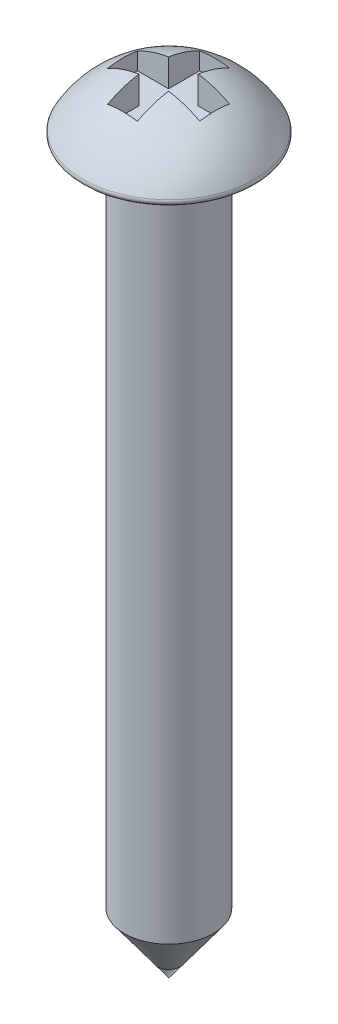
ISO-10303-21;
HEADER;
FILE_DESCRIPTION(('STEP AP214'),'2;1');
FILE_NAME('part.step','',(''),(''),'','','');
FILE_SCHEMA(('AUTOMOTIVE_DESIGN { 1 0 10303 214 1 1 1 1 }'));
ENDSEC;
DATA;
#1=APPLICATION_CONTEXT('core data for automotive mechanical design processes');
#2=APPLICATION_PROTOCOL_DEFINITION('international standard','automotive_design',2000,#1);
#3=PRODUCT_CONTEXT('',#1,'mechanical');
#4=PRODUCT('Part','Part','',(#3));
#5=PRODUCT_RELATED_PRODUCT_CATEGORY('part','',(#4));
#6=PRODUCT_DEFINITION_FORMATION('','',#4);
#7=PRODUCT_DEFINITION_CONTEXT('part definition',#1,'design');
#8=PRODUCT_DEFINITION('design','',#6,#7);
#9=PRODUCT_DEFINITION_SHAPE('','',#8);
#10=(LENGTH_UNIT() NAMED_UNIT(*) SI_UNIT(.MILLI.,.METRE.));
#11=(NAMED_UNIT(*) PLANE_ANGLE_UNIT() SI_UNIT($,.RADIAN.));
#12=(NAMED_UNIT(*) SI_UNIT($,.STERADIAN.) SOLID_ANGLE_UNIT());
#13=UNCERTAINTY_MEASURE_WITH_UNIT(LENGTH_MEASURE(1.E-05),#10,'distance_accuracy_value','');
#14=(GEOMETRIC_REPRESENTATION_CONTEXT(3) GLOBAL_UNCERTAINTY_ASSIGNED_CONTEXT((#13)) GLOBAL_UNIT_ASSIGNED_CONTEXT((#10,
#11,#12)) REPRESENTATION_CONTEXT('',''));
#15=CARTESIAN_POINT('',(0.,0.,0.));
#16=DIRECTION('',(0.,0.,1.));
#17=DIRECTION('',(1.,0.,0.));
#18=AXIS2_PLACEMENT_3D('',#15,#16,#17);
#19=CARTESIAN_POINT('',(0.,-18.,0.));
#20=DIRECTION('',(0.,1.,0.));
#21=DIRECTION('',(-1.,0.,0.));
#22=AXIS2_PLACEMENT_3D('',#19,#20,#21);
#23=CONICAL_SURFACE('',#22,0.,0.632748835002184);
#24=CARTESIAN_POINT('',(0.,-16.5,0.));
#25=DIRECTION('',(0.,1.,0.));
#26=DIRECTION('',(-1.,0.,0.));
#27=AXIS2_PLACEMENT_3D('',#24,#25,#26);
#28=CIRCLE('',#27,1.1);
#29=CARTESIAN_POINT('',(-1.1,-16.5,0.));
#30=VERTEX_POINT('',#29);
#31=EDGE_CURVE('E199',#30,#30,#28,.T.);
#32=ORIENTED_EDGE('',*,*,#31,.F.);
#33=EDGE_LOOP('',(#32));
#34=FACE_BOUND('',#33,.T.);
#35=CARTESIAN_POINT('',(0.,-18.,0.));
#36=VERTEX_POINT('',#35);
#37=VERTEX_LOOP('',#36);
#38=FACE_BOUND('',#37,.T.);
#39=ADVANCED_FACE('F31',(#34,#38),#23,.T.);
#40=CARTESIAN_POINT('',(0.,3.8000547936802,0.));
#41=DIRECTION('',(0.,1.,0.));
#42=DIRECTION('',(-1.,0.,0.));
#43=AXIS2_PLACEMENT_3D('',#40,#41,#42);
#44=CYLINDRICAL_SURFACE('',#43,1.1);
#45=CARTESIAN_POINT('',(0.,0.,0.));
#46=DIRECTION('',(0.,1.,0.));
#47=DIRECTION('',(-1.,0.,0.));
#48=AXIS2_PLACEMENT_3D('',#45,#46,#47);
#49=CIRCLE('',#48,1.1);
#50=CARTESIAN_POINT('',(-1.1,0.,0.));
#51=VERTEX_POINT('',#50);
#52=EDGE_CURVE('E168',#51,#51,#49,.T.);
#53=ORIENTED_EDGE('',*,*,#52,.F.);
#54=EDGE_LOOP('',(#53));
#55=FACE_BOUND('',#54,.T.);
#56=ORIENTED_EDGE('',*,*,#31,.T.);
#57=EDGE_LOOP('',(#56));
#58=FACE_BOUND('',#57,.T.);
#59=ADVANCED_FACE('F277',(#55,#58),#44,.T.);
#60=CARTESIAN_POINT('',(2.2,0.,0.));
#61=DIRECTION('',(0.,1.,0.));
#62=DIRECTION('',(-1.,0.,0.));
#63=AXIS2_PLACEMENT_3D('',#60,#61,#62);
#64=PLANE('',#63);
#65=CARTESIAN_POINT('',(0.,0.,0.));
#66=DIRECTION('',(0.,1.,0.));
#67=DIRECTION('',(-1.,0.,0.));
#68=AXIS2_PLACEMENT_3D('',#65,#66,#67);
#69=CIRCLE('',#68,2.0359463499672);
#70=CARTESIAN_POINT('',(-2.0359463499672,0.,0.));
#71=VERTEX_POINT('',#70);
#72=EDGE_CURVE('E205',#71,#71,#69,.F.);
#73=ORIENTED_EDGE('',*,*,#72,.T.);
#74=EDGE_LOOP('',(#73));
#75=FACE_BOUND('',#74,.T.);
#76=ORIENTED_EDGE('',*,*,#52,.T.);
#77=EDGE_LOOP('',(#76));
#78=FACE_BOUND('',#77,.T.);
#79=ADVANCED_FACE('F282',(#75,#78),#64,.F.);
#80=CARTESIAN_POINT('',(0.,-1.04082556730939,0.));
#81=DIRECTION('',(0.,1.,0.));
#82=DIRECTION('',(1.,0.,0.));
#83=AXIS2_PLACEMENT_3D('',#80,#81,#82);
#84=SPHERICAL_SURFACE('',#83,2.43378673296674);
#85=CARTESIAN_POINT('',(0.,-1.04082556730939,0.370388630185053));
#86=DIRECTION('',(0.,0.,1.));
#87=DIRECTION('',(1.,0.,0.));
#88=AXIS2_PLACEMENT_3D('',#85,#86,#87);
#89=CIRCLE('',#88,2.40543761594321);
#90=CARTESIAN_POINT('',(1.13232028828451,1.08143287334618,0.370388630185053));
#91=VERTEX_POINT('',#90);
#92=CARTESIAN_POINT('',(0.361948002760647,1.33722484584255,0.370388630185053));
#93=VERTEX_POINT('',#92);
#94=EDGE_CURVE('E208',#91,#93,#89,.T.);
#95=ORIENTED_EDGE('',*,*,#94,.T.);
#96=CARTESIAN_POINT('',(0.361948002760647,-1.04082556730939,0.));
#97=DIRECTION('',(1.,0.,0.));
#98=DIRECTION('',(0.,0.,-1.));
#99=AXIS2_PLACEMENT_3D('',#96,#97,#98);
#100=CIRCLE('',#99,2.40672214949348);
#101=CARTESIAN_POINT('',(0.361948002760647,1.07836674063565,1.14076091570892));
#102=VERTEX_POINT('',#101);
#103=EDGE_CURVE('E11',#93,#102,#100,.T.);
#104=ORIENTED_EDGE('',*,*,#103,.T.);
#105=CARTESIAN_POINT('',(0.,-1.04082556730939,1.14076091570892));
#106=DIRECTION('',(0.,0.,1.));
#107=DIRECTION('',(1.,0.,0.));
#108=AXIS2_PLACEMENT_3D('',#105,#106,#107);
#109=CIRCLE('',#108,2.14987962331752);
#110=CARTESIAN_POINT('',(-0.371599949500931,1.07669559487218,1.14076091570892));
#111=VERTEX_POINT('',#110);
#112=EDGE_CURVE('E38',#102,#111,#109,.T.);
#113=ORIENTED_EDGE('',*,*,#112,.T.);
#114=CARTESIAN_POINT('',(-0.371599949500931,-1.04082556730939,0.));
#115=DIRECTION('',(-1.,0.,0.));
#116=DIRECTION('',(0.,0.,1.));
#117=AXIS2_PLACEMENT_3D('',#114,#115,#116);
#118=CIRCLE('',#117,2.40525078507332);
#119=CARTESIAN_POINT('',(-0.371599949500931,1.3357357303906,0.370388630185053));
#120=VERTEX_POINT('',#119);
#121=EDGE_CURVE('E234',#111,#120,#118,.T.);
#122=ORIENTED_EDGE('',*,*,#121,.T.);
#123=CARTESIAN_POINT('',(0.,-1.04082556730939,0.370388630185053));
#124=DIRECTION('',(0.,0.,1.));
#125=DIRECTION('',(1.,0.,0.));
#126=AXIS2_PLACEMENT_3D('',#123,#124,#125);
#127=CIRCLE('',#126,2.40543761594321);
#128=CARTESIAN_POINT('',(-1.14197223502479,1.07625486069211,0.370388630185054));
#129=VERTEX_POINT('',#128);
#130=EDGE_CURVE('E231',#120,#129,#127,.T.);
#131=ORIENTED_EDGE('',*,*,#130,.T.);
#132=CARTESIAN_POINT('',(-1.14197223502479,-1.04082556730939,0.));
#133=DIRECTION('',(-1.,0.,0.));
#134=DIRECTION('',(0.,0.,1.));
#135=AXIS2_PLACEMENT_3D('',#132,#133,#134);
#136=CIRCLE('',#135,2.14923644022648);
#137=CARTESIAN_POINT('',(-1.14197223502479,1.07750693321698,-0.363159322076525));
#138=VERTEX_POINT('',#137);
#139=EDGE_CURVE('E228',#129,#138,#136,.T.);
#140=ORIENTED_EDGE('',*,*,#139,.T.);
#141=CARTESIAN_POINT('',(0.,-1.04082556730939,-0.363159322076525));
#142=DIRECTION('',(0.,0.,-1.));
#143=DIRECTION('',(-1.,0.,0.));
#144=AXIS2_PLACEMENT_3D('',#141,#142,#143);
#145=CIRCLE('',#144,2.40653966689806);
#146=CARTESIAN_POINT('',(-0.371599949500931,1.33685116552978,-0.363159322076525));
#147=VERTEX_POINT('',#146);
#148=EDGE_CURVE('E225',#138,#147,#145,.T.);
#149=ORIENTED_EDGE('',*,*,#148,.T.);
#150=CARTESIAN_POINT('',(-0.371599949500931,-1.04082556730939,0.));
#151=DIRECTION('',(-1.,0.,0.));
#152=DIRECTION('',(0.,0.,1.));
#153=AXIS2_PLACEMENT_3D('',#150,#151,#152);
#154=CIRCLE('',#153,2.40525078507332);
#155=CARTESIAN_POINT('',(-0.371599949500931,1.08057430863731,-1.13353160760039));
#156=VERTEX_POINT('',#155);
#157=EDGE_CURVE('E222',#147,#156,#154,.T.);
#158=ORIENTED_EDGE('',*,*,#157,.T.);
#159=CARTESIAN_POINT('',(0.,-1.04082556730939,-1.13353160760039));
#160=DIRECTION('',(0.,0.,-1.));
#161=DIRECTION('',(-1.,0.,0.));
#162=AXIS2_PLACEMENT_3D('',#159,#160,#161);
#163=CIRCLE('',#162,2.15370006178572);
#164=CARTESIAN_POINT('',(0.361948002760647,1.08224240132312,-1.13353160760039));
#165=VERTEX_POINT('',#164);
#166=EDGE_CURVE('E219',#156,#165,#163,.T.);
#167=ORIENTED_EDGE('',*,*,#166,.T.);
#168=CARTESIAN_POINT('',(0.361948002760647,-1.04082556730939,0.));
#169=DIRECTION('',(1.,0.,0.));
#170=DIRECTION('',(0.,0.,-1.));
#171=AXIS2_PLACEMENT_3D('',#168,#169,#170);
#172=CIRCLE('',#171,2.40672214949348);
#173=CARTESIAN_POINT('',(0.361948002760647,1.33833958283286,-0.363159322076525));
#174=VERTEX_POINT('',#173);
#175=EDGE_CURVE('E216',#165,#174,#172,.T.);
#176=ORIENTED_EDGE('',*,*,#175,.T.);
#177=CARTESIAN_POINT('',(0.,-1.04082556730939,-0.363159322076525));
#178=DIRECTION('',(0.,0.,-1.));
#179=DIRECTION('',(-1.,0.,0.));
#180=AXIS2_PLACEMENT_3D('',#177,#178,#179);
#181=CIRCLE('',#180,2.40653966689806);
#182=CARTESIAN_POINT('',(1.13232028828451,1.0826818927889,-0.363159322076525));
#183=VERTEX_POINT('',#182);
#184=EDGE_CURVE('E213',#174,#183,#181,.T.);
#185=ORIENTED_EDGE('',*,*,#184,.T.);
#186=CARTESIAN_POINT('',(1.13232028828451,-1.04082556730939,0.));
#187=DIRECTION('',(1.,0.,0.));
#188=DIRECTION('',(0.,0.,-1.));
#189=AXIS2_PLACEMENT_3D('',#186,#187,#188);
#190=CIRCLE('',#189,2.15433716634704);
#191=EDGE_CURVE('E210',#183,#91,#190,.T.);
#192=ORIENTED_EDGE('',*,*,#191,.T.);
#193=EDGE_LOOP('',(#95,#104,#113,#122,#131,#140,#149,#158,#167,#176,#185,#192));
#194=FACE_BOUND('',#193,.T.);
#195=CARTESIAN_POINT('',(0.,0.148883025650727,0.));
#196=DIRECTION('',(0.,-1.,0.));
#197=DIRECTION('',(1.,0.,0.));
#198=AXIS2_PLACEMENT_3D('',#195,#196,#197);
#199=CIRCLE('',#198,2.12318424198226);
#200=CARTESIAN_POINT('',(2.12318424198226,0.148883025650727,0.));
#201=VERTEX_POINT('',#200);
#202=EDGE_CURVE('E202',#201,#201,#199,.F.);
#203=ORIENTED_EDGE('',*,*,#202,.T.);
#204=EDGE_LOOP('',(#203));
#205=FACE_BOUND('',#204,.T.);
#206=ADVANCED_FACE('F238',(#194,#205),#84,.T.);
#207=CARTESIAN_POINT('',(0.,0.0999999999999998,0.));
#208=DIRECTION('',(0.,1.,0.));
#209=DIRECTION('',(-1.,0.,0.));
#210=AXIS2_PLACEMENT_3D('',#207,#208,#209);
#211=TOROIDAL_SURFACE('',#210,2.0359463499672,0.1);
#212=ORIENTED_EDGE('',*,*,#72,.F.);
#213=EDGE_LOOP('',(#212));
#214=FACE_BOUND('',#213,.T.);
#215=ORIENTED_EDGE('',*,*,#202,.F.);
#216=EDGE_LOOP('',(#215));
#217=FACE_BOUND('',#216,.T.);
#218=ADVANCED_FACE('F295',(#214,#217),#211,.T.);
#219=CARTESIAN_POINT('',(0.361948002760647,0.656537419888082,1.14076091570892));
#220=DIRECTION('',(1.,0.,0.));
#221=DIRECTION('',(0.,0.,-1.));
#222=AXIS2_PLACEMENT_3D('',#219,#220,#221);
#223=PLANE('',#222);
#224=DIRECTION('',(0.,1.,0.));
#225=VECTOR('',#224,1.);
#226=CARTESIAN_POINT('',(0.361948002760647,0.656537419888082,0.370388630185053));
#227=LINE('',#226,#225);
#228=CARTESIAN_POINT('',(0.361948002760647,0.656537419888082,0.370388630185053));
#229=VERTEX_POINT('',#228);
#230=EDGE_CURVE('E45',#229,#93,#227,.T.);
#231=ORIENTED_EDGE('',*,*,#230,.F.);
#232=DIRECTION('',(0.,0.,-1.));
#233=VECTOR('',#232,1.);
#234=CARTESIAN_POINT('',(0.361948002760647,0.656537419888082,1.14076091570892));
#235=LINE('',#234,#233);
#236=CARTESIAN_POINT('',(0.361948002760647,0.656537419888082,1.14076091570892));
#237=VERTEX_POINT('',#236);
#238=EDGE_CURVE('E121',#237,#229,#235,.T.);
#239=ORIENTED_EDGE('',*,*,#238,.F.);
#240=DIRECTION('',(0.,1.,0.));
#241=VECTOR('',#240,1.);
#242=CARTESIAN_POINT('',(0.361948002760647,0.656537419888082,1.14076091570892));
#243=LINE('',#242,#241);
#244=EDGE_CURVE('E166',#237,#102,#243,.T.);
#245=ORIENTED_EDGE('',*,*,#244,.T.);
#246=ORIENTED_EDGE('',*,*,#103,.F.);
#247=EDGE_LOOP('',(#231,#239,#245,#246));
#248=FACE_BOUND('',#247,.T.);
#249=ADVANCED_FACE('F118',(#248),#223,.F.);
#250=CARTESIAN_POINT('',(0.361948002760647,0.656537419888082,1.14076091570892));
#251=DIRECTION('',(0.,0.,1.));
#252=DIRECTION('',(1.,0.,0.));
#253=AXIS2_PLACEMENT_3D('',#250,#251,#252);
#254=PLANE('',#253);
#255=ORIENTED_EDGE('',*,*,#244,.F.);
#256=DIRECTION('',(1.,0.,0.));
#257=VECTOR('',#256,1.);
#258=CARTESIAN_POINT('',(0.361948002760647,0.656537419888082,1.14076091570892));
#259=LINE('',#258,#257);
#260=CARTESIAN_POINT('',(-0.371599949500931,0.656537419888082,1.14076091570892));
#261=VERTEX_POINT('',#260);
#262=EDGE_CURVE('E125',#261,#237,#259,.T.);
#263=ORIENTED_EDGE('',*,*,#262,.F.);
#264=DIRECTION('',(0.,1.,0.));
#265=VECTOR('',#264,1.);
#266=CARTESIAN_POINT('',(-0.371599949500931,0.656537419888082,1.14076091570892));
#267=LINE('',#266,#265);
#268=EDGE_CURVE('E169',#261,#111,#267,.T.);
#269=ORIENTED_EDGE('',*,*,#268,.T.);
#270=ORIENTED_EDGE('',*,*,#112,.F.);
#271=EDGE_LOOP('',(#255,#263,#269,#270));
#272=FACE_BOUND('',#271,.T.);
#273=ADVANCED_FACE('F241',(#272),#254,.F.);
#274=CARTESIAN_POINT('',(-0.371599949500931,0.656537419888082,1.14076091570892));
#275=DIRECTION('',(-1.,0.,0.));
#276=DIRECTION('',(0.,0.,1.));
#277=AXIS2_PLACEMENT_3D('',#274,#275,#276);
#278=PLANE('',#277);
#279=ORIENTED_EDGE('',*,*,#268,.F.);
#280=DIRECTION('',(0.,0.,1.));
#281=VECTOR('',#280,1.);
#282=CARTESIAN_POINT('',(-0.371599949500931,0.656537419888082,1.14076091570892));
#283=LINE('',#282,#281);
#284=CARTESIAN_POINT('',(-0.371599949500931,0.656537419888082,0.370388630185053));
#285=VERTEX_POINT('',#284);
#286=EDGE_CURVE('E163',#285,#261,#283,.T.);
#287=ORIENTED_EDGE('',*,*,#286,.F.);
#288=DIRECTION('',(0.,1.,0.));
#289=VECTOR('',#288,1.);
#290=CARTESIAN_POINT('',(-0.371599949500931,0.656537419888082,0.370388630185053));
#291=LINE('',#290,#289);
#292=EDGE_CURVE('E172',#285,#120,#291,.T.);
#293=ORIENTED_EDGE('',*,*,#292,.T.);
#294=ORIENTED_EDGE('',*,*,#121,.F.);
#295=EDGE_LOOP('',(#279,#287,#293,#294));
#296=FACE_BOUND('',#295,.T.);
#297=ADVANCED_FACE('F244',(#296),#278,.F.);
#298=CARTESIAN_POINT('',(-0.371599949500931,0.656537419888082,0.370388630185053));
#299=DIRECTION('',(0.,0.,1.));
#300=DIRECTION('',(1.,0.,0.));
#301=AXIS2_PLACEMENT_3D('',#298,#299,#300);
#302=PLANE('',#301);
#303=ORIENTED_EDGE('',*,*,#292,.F.);
#304=DIRECTION('',(1.,0.,0.));
#305=VECTOR('',#304,1.);
#306=CARTESIAN_POINT('',(-0.371599949500931,0.656537419888082,0.370388630185053));
#307=LINE('',#306,#305);
#308=CARTESIAN_POINT('',(-1.14197223502479,0.656537419888082,0.370388630185054));
#309=VERTEX_POINT('',#308);
#310=EDGE_CURVE('E160',#309,#285,#307,.T.);
#311=ORIENTED_EDGE('',*,*,#310,.F.);
#312=DIRECTION('',(0.,1.,0.));
#313=VECTOR('',#312,1.);
#314=CARTESIAN_POINT('',(-1.14197223502479,0.656537419888082,0.370388630185054));
#315=LINE('',#314,#313);
#316=EDGE_CURVE('E175',#309,#129,#315,.T.);
#317=ORIENTED_EDGE('',*,*,#316,.T.);
#318=ORIENTED_EDGE('',*,*,#130,.F.);
#319=EDGE_LOOP('',(#303,#311,#317,#318));
#320=FACE_BOUND('',#319,.T.);
#321=ADVANCED_FACE('F248',(#320),#302,.F.);
#322=CARTESIAN_POINT('',(-1.14197223502479,0.656537419888082,0.370388630185054));
#323=DIRECTION('',(-1.,0.,0.));
#324=DIRECTION('',(0.,0.,1.));
#325=AXIS2_PLACEMENT_3D('',#322,#323,#324);
#326=PLANE('',#325);
#327=ORIENTED_EDGE('',*,*,#316,.F.);
#328=DIRECTION('',(0.,0.,1.));
#329=VECTOR('',#328,1.);
#330=CARTESIAN_POINT('',(-1.14197223502479,0.656537419888082,0.370388630185054));
#331=LINE('',#330,#329);
#332=CARTESIAN_POINT('',(-1.14197223502479,0.656537419888082,-0.363159322076525));
#333=VERTEX_POINT('',#332);
#334=EDGE_CURVE('E157',#333,#309,#331,.T.);
#335=ORIENTED_EDGE('',*,*,#334,.F.);
#336=DIRECTION('',(0.,1.,0.));
#337=VECTOR('',#336,1.);
#338=CARTESIAN_POINT('',(-1.14197223502479,0.656537419888082,-0.363159322076525));
#339=LINE('',#338,#337);
#340=EDGE_CURVE('E178',#333,#138,#339,.T.);
#341=ORIENTED_EDGE('',*,*,#340,.T.);
#342=ORIENTED_EDGE('',*,*,#139,.F.);
#343=EDGE_LOOP('',(#327,#335,#341,#342));
#344=FACE_BOUND('',#343,.T.);
#345=ADVANCED_FACE('F250',(#344),#326,.F.);
#346=CARTESIAN_POINT('',(-0.371599949500931,0.656537419888082,-0.363159322076525));
#347=DIRECTION('',(0.,0.,-1.));
#348=DIRECTION('',(-1.,0.,0.));
#349=AXIS2_PLACEMENT_3D('',#346,#347,#348);
#350=PLANE('',#349);
#351=ORIENTED_EDGE('',*,*,#340,.F.);
#352=DIRECTION('',(-1.,0.,0.));
#353=VECTOR('',#352,1.);
#354=CARTESIAN_POINT('',(-0.371599949500931,0.656537419888082,-0.363159322076525));
#355=LINE('',#354,#353);
#356=CARTESIAN_POINT('',(-0.371599949500931,0.656537419888082,-0.363159322076525));
#357=VERTEX_POINT('',#356);
#358=EDGE_CURVE('E154',#357,#333,#355,.T.);
#359=ORIENTED_EDGE('',*,*,#358,.F.);
#360=DIRECTION('',(0.,1.,0.));
#361=VECTOR('',#360,1.);
#362=CARTESIAN_POINT('',(-0.371599949500931,0.656537419888082,-0.363159322076525));
#363=LINE('',#362,#361);
#364=EDGE_CURVE('E181',#357,#147,#363,.T.);
#365=ORIENTED_EDGE('',*,*,#364,.T.);
#366=ORIENTED_EDGE('',*,*,#148,.F.);
#367=EDGE_LOOP('',(#351,#359,#365,#366));
#368=FACE_BOUND('',#367,.T.);
#369=ADVANCED_FACE('F253',(#368),#350,.F.);
#370=CARTESIAN_POINT('',(-0.371599949500931,0.656537419888082,-0.363159322076525));
#371=DIRECTION('',(-1.,0.,0.));
#372=DIRECTION('',(0.,0.,1.));
#373=AXIS2_PLACEMENT_3D('',#370,#371,#372);
#374=PLANE('',#373);
#375=ORIENTED_EDGE('',*,*,#364,.F.);
#376=DIRECTION('',(0.,0.,1.));
#377=VECTOR('',#376,1.);
#378=CARTESIAN_POINT('',(-0.371599949500931,0.656537419888082,-0.363159322076525));
#379=LINE('',#378,#377);
#380=CARTESIAN_POINT('',(-0.371599949500931,0.656537419888082,-1.13353160760039));
#381=VERTEX_POINT('',#380);
#382=EDGE_CURVE('E151',#381,#357,#379,.T.);
#383=ORIENTED_EDGE('',*,*,#382,.F.);
#384=DIRECTION('',(0.,1.,0.));
#385=VECTOR('',#384,1.);
#386=CARTESIAN_POINT('',(-0.371599949500931,0.656537419888082,-1.13353160760039));
#387=LINE('',#386,#385);
#388=EDGE_CURVE('E184',#381,#156,#387,.T.);
#389=ORIENTED_EDGE('',*,*,#388,.T.);
#390=ORIENTED_EDGE('',*,*,#157,.F.);
#391=EDGE_LOOP('',(#375,#383,#389,#390));
#392=FACE_BOUND('',#391,.T.);
#393=ADVANCED_FACE('F256',(#392),#374,.F.);
#394=CARTESIAN_POINT('',(0.361948002760647,0.656537419888082,-1.13353160760039));
#395=DIRECTION('',(0.,0.,-1.));
#396=DIRECTION('',(-1.,0.,0.));
#397=AXIS2_PLACEMENT_3D('',#394,#395,#396);
#398=PLANE('',#397);
#399=ORIENTED_EDGE('',*,*,#388,.F.);
#400=DIRECTION('',(-1.,0.,0.));
#401=VECTOR('',#400,1.);
#402=CARTESIAN_POINT('',(0.361948002760647,0.656537419888082,-1.13353160760039));
#403=LINE('',#402,#401);
#404=CARTESIAN_POINT('',(0.361948002760647,0.656537419888082,-1.13353160760039));
#405=VERTEX_POINT('',#404);
#406=EDGE_CURVE('E148',#405,#381,#403,.T.);
#407=ORIENTED_EDGE('',*,*,#406,.F.);
#408=DIRECTION('',(0.,1.,0.));
#409=VECTOR('',#408,1.);
#410=CARTESIAN_POINT('',(0.361948002760647,0.656537419888082,-1.13353160760039));
#411=LINE('',#410,#409);
#412=EDGE_CURVE('E187',#405,#165,#411,.T.);
#413=ORIENTED_EDGE('',*,*,#412,.T.);
#414=ORIENTED_EDGE('',*,*,#166,.F.);
#415=EDGE_LOOP('',(#399,#407,#413,#414));
#416=FACE_BOUND('',#415,.T.);
#417=ADVANCED_FACE('F258',(#416),#398,.F.);
#418=CARTESIAN_POINT('',(0.361948002760647,0.656537419888082,-0.363159322076525));
#419=DIRECTION('',(1.,0.,0.));
#420=DIRECTION('',(0.,0.,-1.));
#421=AXIS2_PLACEMENT_3D('',#418,#419,#420);
#422=PLANE('',#421);
#423=ORIENTED_EDGE('',*,*,#412,.F.);
#424=DIRECTION('',(0.,0.,-1.));
#425=VECTOR('',#424,1.);
#426=CARTESIAN_POINT('',(0.361948002760647,0.656537419888082,-0.363159322076525));
#427=LINE('',#426,#425);
#428=CARTESIAN_POINT('',(0.361948002760647,0.656537419888082,-0.363159322076525));
#429=VERTEX_POINT('',#428);
#430=EDGE_CURVE('E145',#429,#405,#427,.T.);
#431=ORIENTED_EDGE('',*,*,#430,.F.);
#432=DIRECTION('',(0.,1.,0.));
#433=VECTOR('',#432,1.);
#434=CARTESIAN_POINT('',(0.361948002760647,0.656537419888082,-0.363159322076525));
#435=LINE('',#434,#433);
#436=EDGE_CURVE('E190',#429,#174,#435,.T.);
#437=ORIENTED_EDGE('',*,*,#436,.T.);
#438=ORIENTED_EDGE('',*,*,#175,.F.);
#439=EDGE_LOOP('',(#423,#431,#437,#438));
#440=FACE_BOUND('',#439,.T.);
#441=ADVANCED_FACE('F262',(#440),#422,.F.);
#442=CARTESIAN_POINT('',(1.13232028828451,0.656537419888082,-0.363159322076525));
#443=DIRECTION('',(0.,0.,-1.));
#444=DIRECTION('',(-1.,0.,0.));
#445=AXIS2_PLACEMENT_3D('',#442,#443,#444);
#446=PLANE('',#445);
#447=ORIENTED_EDGE('',*,*,#436,.F.);
#448=DIRECTION('',(-1.,0.,0.));
#449=VECTOR('',#448,1.);
#450=CARTESIAN_POINT('',(1.13232028828451,0.656537419888082,-0.363159322076525));
#451=LINE('',#450,#449);
#452=CARTESIAN_POINT('',(1.13232028828451,0.656537419888082,-0.363159322076525));
#453=VERTEX_POINT('',#452);
#454=EDGE_CURVE('E142',#453,#429,#451,.T.);
#455=ORIENTED_EDGE('',*,*,#454,.F.);
#456=DIRECTION('',(0.,1.,0.));
#457=VECTOR('',#456,1.);
#458=CARTESIAN_POINT('',(1.13232028828451,0.656537419888082,-0.363159322076525));
#459=LINE('',#458,#457);
#460=EDGE_CURVE('E193',#453,#183,#459,.T.);
#461=ORIENTED_EDGE('',*,*,#460,.T.);
#462=ORIENTED_EDGE('',*,*,#184,.F.);
#463=EDGE_LOOP('',(#447,#455,#461,#462));
#464=FACE_BOUND('',#463,.T.);
#465=ADVANCED_FACE('F265',(#464),#446,.F.);
#466=CARTESIAN_POINT('',(1.13232028828451,0.656537419888082,0.370388630185053));
#467=DIRECTION('',(1.,0.,0.));
#468=DIRECTION('',(0.,0.,-1.));
#469=AXIS2_PLACEMENT_3D('',#466,#467,#468);
#470=PLANE('',#469);
#471=ORIENTED_EDGE('',*,*,#460,.F.);
#472=DIRECTION('',(0.,0.,-1.));
#473=VECTOR('',#472,1.);
#474=CARTESIAN_POINT('',(1.13232028828451,0.656537419888082,0.370388630185053));
#475=LINE('',#474,#473);
#476=CARTESIAN_POINT('',(1.13232028828451,0.656537419888082,0.370388630185053));
#477=VERTEX_POINT('',#476);
#478=EDGE_CURVE('E134',#477,#453,#475,.T.);
#479=ORIENTED_EDGE('',*,*,#478,.F.);
#480=DIRECTION('',(0.,1.,0.));
#481=VECTOR('',#480,1.);
#482=CARTESIAN_POINT('',(1.13232028828451,0.656537419888082,0.370388630185053));
#483=LINE('',#482,#481);
#484=EDGE_CURVE('E124',#477,#91,#483,.T.);
#485=ORIENTED_EDGE('',*,*,#484,.T.);
#486=ORIENTED_EDGE('',*,*,#191,.F.);
#487=EDGE_LOOP('',(#471,#479,#485,#486));
#488=FACE_BOUND('',#487,.T.);
#489=ADVANCED_FACE('F267',(#488),#470,.F.);
#490=CARTESIAN_POINT('',(1.13232028828451,0.656537419888082,0.370388630185053));
#491=DIRECTION('',(0.,0.,1.));
#492=DIRECTION('',(1.,0.,0.));
#493=AXIS2_PLACEMENT_3D('',#490,#491,#492);
#494=PLANE('',#493);
#495=ORIENTED_EDGE('',*,*,#484,.F.);
#496=DIRECTION('',(1.,0.,0.));
#497=VECTOR('',#496,1.);
#498=CARTESIAN_POINT('',(1.13232028828451,0.656537419888082,0.370388630185053));
#499=LINE('',#498,#497);
#500=EDGE_CURVE('E128',#229,#477,#499,.T.);
#501=ORIENTED_EDGE('',*,*,#500,.F.);
#502=ORIENTED_EDGE('',*,*,#230,.T.);
#503=ORIENTED_EDGE('',*,*,#94,.F.);
#504=EDGE_LOOP('',(#495,#501,#502,#503));
#505=FACE_BOUND('',#504,.T.);
#506=ADVANCED_FACE('F129',(#505),#494,.F.);
#507=CARTESIAN_POINT('',(0.361948002760647,0.656537419888082,-1.13353160760039));
#508=DIRECTION('',(0.,1.,0.));
#509=DIRECTION('',(0.,0.,1.));
#510=AXIS2_PLACEMENT_3D('',#507,#508,#509);
#511=PLANE('',#510);
#512=ORIENTED_EDGE('',*,*,#238,.T.);
#513=ORIENTED_EDGE('',*,*,#500,.T.);
#514=ORIENTED_EDGE('',*,*,#478,.T.);
#515=ORIENTED_EDGE('',*,*,#454,.T.);
#516=ORIENTED_EDGE('',*,*,#430,.T.);
#517=ORIENTED_EDGE('',*,*,#406,.T.);
#518=ORIENTED_EDGE('',*,*,#382,.T.);
#519=ORIENTED_EDGE('',*,*,#358,.T.);
#520=ORIENTED_EDGE('',*,*,#334,.T.);
#521=ORIENTED_EDGE('',*,*,#310,.T.);
#522=ORIENTED_EDGE('',*,*,#286,.T.);
#523=ORIENTED_EDGE('',*,*,#262,.T.);
#524=EDGE_LOOP('',(#512,#513,#514,#515,#516,#517,#518,#519,#520,#521,#522,#523));
#525=FACE_BOUND('',#524,.T.);
#526=ADVANCED_FACE('F136',(#525),#511,.T.);
#527=CLOSED_SHELL('',(#39,#59,#79,#206,#218,#249,#273,#297,#321,#345,#369,#393,#417,#441,#465,
#489,#506,#526));
#528=MANIFOLD_SOLID_BREP('B2',#527);
#529=ADVANCED_BREP_SHAPE_REPRESENTATION('',(#18,#528),#14);
#530=SHAPE_DEFINITION_REPRESENTATION(#9,#529);
ENDSEC;
END-ISO-10303-21;
